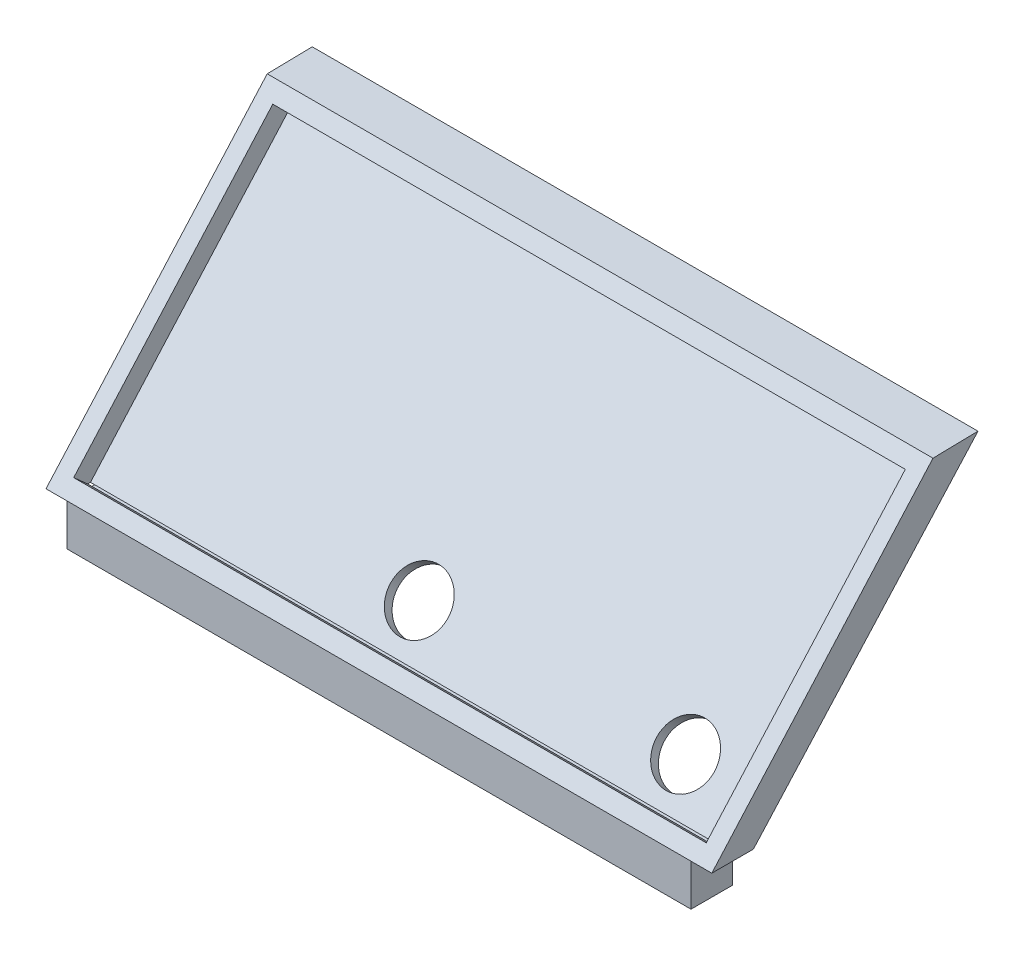
ISO-10303-21;
HEADER;
FILE_DESCRIPTION(('STEP AP214'),'2;1');
FILE_NAME('part.step','',(''),(''),'','','');
FILE_SCHEMA(('AUTOMOTIVE_DESIGN { 1 0 10303 214 1 1 1 1 }'));
ENDSEC;
DATA;
#1=APPLICATION_CONTEXT('core data for automotive mechanical design processes');
#2=APPLICATION_PROTOCOL_DEFINITION('international standard','automotive_design',2000,#1);
#3=PRODUCT_CONTEXT('',#1,'mechanical');
#4=PRODUCT('Part','Part','',(#3));
#5=PRODUCT_RELATED_PRODUCT_CATEGORY('part','',(#4));
#6=PRODUCT_DEFINITION_FORMATION('','',#4);
#7=PRODUCT_DEFINITION_CONTEXT('part definition',#1,'design');
#8=PRODUCT_DEFINITION('design','',#6,#7);
#9=PRODUCT_DEFINITION_SHAPE('','',#8);
#10=(LENGTH_UNIT() NAMED_UNIT(*) SI_UNIT(.MILLI.,.METRE.));
#11=(NAMED_UNIT(*) PLANE_ANGLE_UNIT() SI_UNIT($,.RADIAN.));
#12=(NAMED_UNIT(*) SI_UNIT($,.STERADIAN.) SOLID_ANGLE_UNIT());
#13=UNCERTAINTY_MEASURE_WITH_UNIT(LENGTH_MEASURE(1.E-05),#10,'distance_accuracy_value','');
#14=(GEOMETRIC_REPRESENTATION_CONTEXT(3) GLOBAL_UNCERTAINTY_ASSIGNED_CONTEXT((#13)) GLOBAL_UNIT_ASSIGNED_CONTEXT((#10,
#11,#12)) REPRESENTATION_CONTEXT('',''));
#15=CARTESIAN_POINT('',(0.,0.,0.));
#16=DIRECTION('',(0.,0.,1.));
#17=DIRECTION('',(1.,0.,0.));
#18=AXIS2_PLACEMENT_3D('',#15,#16,#17);
#19=CARTESIAN_POINT('',(48.26,25.4,-79.3512959841052));
#20=DIRECTION('',(0.,1.,0.));
#21=DIRECTION('',(-1.,0.,0.));
#22=AXIS2_PLACEMENT_3D('',#19,#20,#21);
#23=PLANE('',#22);
#24=DIRECTION('',(0.,0.,-1.));
#25=VECTOR('',#24,1.);
#26=CARTESIAN_POINT('',(-47.625,25.4,-73.0012959841052));
#27=LINE('',#26,#25);
#28=CARTESIAN_POINT('',(-47.625,25.4,-73.0012959841052));
#29=VERTEX_POINT('',#28);
#30=CARTESIAN_POINT('',(-47.625,25.4,-76.8238639337023));
#31=VERTEX_POINT('',#30);
#32=EDGE_CURVE('E57',#29,#31,#27,.T.);
#33=ORIENTED_EDGE('',*,*,#32,.F.);
#34=DIRECTION('',(-1.,0.,0.));
#35=VECTOR('',#34,1.);
#36=CARTESIAN_POINT('',(0.,25.4,-73.0012959841052));
#37=LINE('',#36,#35);
#38=CARTESIAN_POINT('',(-50.8,25.4,-73.0012959841052));
#39=VERTEX_POINT('',#38);
#40=EDGE_CURVE('E290',#29,#39,#37,.T.);
#41=ORIENTED_EDGE('',*,*,#40,.T.);
#42=DIRECTION('',(0.,0.,1.));
#43=VECTOR('',#42,1.);
#44=CARTESIAN_POINT('',(-50.8,25.4,-79.3512959841052));
#45=LINE('',#44,#43);
#46=CARTESIAN_POINT('',(-50.8,25.4,-79.3512959841052));
#47=VERTEX_POINT('',#46);
#48=EDGE_CURVE('E212',#47,#39,#45,.T.);
#49=ORIENTED_EDGE('',*,*,#48,.F.);
#50=DIRECTION('',(-1.,0.,0.));
#51=VECTOR('',#50,1.);
#52=CARTESIAN_POINT('',(0.,25.4,-79.3512959841052));
#53=LINE('',#52,#51);
#54=CARTESIAN_POINT('',(-47.625,25.4,-79.3512959841052));
#55=VERTEX_POINT('',#54);
#56=EDGE_CURVE('E65',#55,#47,#53,.T.);
#57=ORIENTED_EDGE('',*,*,#56,.F.);
#58=CARTESIAN_POINT('',(-47.625,25.4,-77.2498636105856));
#59=VERTEX_POINT('',#58);
#60=EDGE_CURVE('E11',#59,#55,#27,.T.);
#61=ORIENTED_EDGE('',*,*,#60,.F.);
#62=DIRECTION('',(1.,0.,0.));
#63=VECTOR('',#62,1.);
#64=CARTESIAN_POINT('',(48.26,25.4,-77.2498636105857));
#65=LINE('',#64,#63);
#66=CARTESIAN_POINT('',(-48.26,25.4,-77.2498636105856));
#67=VERTEX_POINT('',#66);
#68=EDGE_CURVE('E299',#67,#59,#65,.T.);
#69=ORIENTED_EDGE('',*,*,#68,.F.);
#70=DIRECTION('',(0.,0.,-1.));
#71=VECTOR('',#70,1.);
#72=CARTESIAN_POINT('',(-48.26,25.4,-200.66));
#73=LINE('',#72,#71);
#74=CARTESIAN_POINT('',(-48.26,25.4,-76.8238639337022));
#75=VERTEX_POINT('',#74);
#76=EDGE_CURVE('E217',#75,#67,#73,.T.);
#77=ORIENTED_EDGE('',*,*,#76,.F.);
#78=DIRECTION('',(1.,0.,0.));
#79=VECTOR('',#78,1.);
#80=CARTESIAN_POINT('',(48.26,25.4,-76.8238639337022));
#81=LINE('',#80,#79);
#82=EDGE_CURVE('E49',#75,#31,#81,.T.);
#83=ORIENTED_EDGE('',*,*,#82,.T.);
#84=EDGE_LOOP('',(#33,#41,#49,#57,#61,#69,#77,#83));
#85=FACE_BOUND('',#84,.T.);
#86=ADVANCED_FACE('F45',(#85),#23,.F.);
#87=DIRECTION('',(0.,0.,1.));
#88=VECTOR('',#87,1.);
#89=CARTESIAN_POINT('',(47.625,25.4,-73.0012959841052));
#90=LINE('',#89,#88);
#91=CARTESIAN_POINT('',(47.625,25.4,-79.3512959841052));
#92=VERTEX_POINT('',#91);
#93=CARTESIAN_POINT('',(47.625,25.4,-77.2498636105857));
#94=VERTEX_POINT('',#93);
#95=EDGE_CURVE('E73',#92,#94,#90,.T.);
#96=ORIENTED_EDGE('',*,*,#95,.F.);
#97=CARTESIAN_POINT('',(50.8,25.4,-79.3512959841052));
#98=VERTEX_POINT('',#97);
#99=EDGE_CURVE('E296',#98,#92,#53,.T.);
#100=ORIENTED_EDGE('',*,*,#99,.F.);
#101=DIRECTION('',(0.,0.,1.));
#102=VECTOR('',#101,1.);
#103=CARTESIAN_POINT('',(50.8,25.4,-79.3512959841052));
#104=LINE('',#103,#102);
#105=CARTESIAN_POINT('',(50.8,25.4,-73.0012959841052));
#106=VERTEX_POINT('',#105);
#107=EDGE_CURVE('E208',#98,#106,#104,.T.);
#108=ORIENTED_EDGE('',*,*,#107,.T.);
#109=CARTESIAN_POINT('',(47.625,25.4,-73.0012959841052));
#110=VERTEX_POINT('',#109);
#111=EDGE_CURVE('E293',#106,#110,#37,.T.);
#112=ORIENTED_EDGE('',*,*,#111,.T.);
#113=CARTESIAN_POINT('',(47.625,25.4,-76.8238639337022));
#114=VERTEX_POINT('',#113);
#115=EDGE_CURVE('E55',#114,#110,#90,.T.);
#116=ORIENTED_EDGE('',*,*,#115,.F.);
#117=CARTESIAN_POINT('',(48.26,25.4,-76.8238639337023));
#118=VERTEX_POINT('',#117);
#119=EDGE_CURVE('E302',#114,#118,#81,.T.);
#120=ORIENTED_EDGE('',*,*,#119,.T.);
#121=DIRECTION('',(0.,0.,1.));
#122=VECTOR('',#121,1.);
#123=CARTESIAN_POINT('',(48.26,25.4,-200.66));
#124=LINE('',#123,#122);
#125=CARTESIAN_POINT('',(48.26,25.4,-77.2498636105856));
#126=VERTEX_POINT('',#125);
#127=EDGE_CURVE('E216',#126,#118,#124,.T.);
#128=ORIENTED_EDGE('',*,*,#127,.F.);
#129=EDGE_CURVE('E298',#94,#126,#65,.T.);
#130=ORIENTED_EDGE('',*,*,#129,.F.);
#131=EDGE_LOOP('',(#96,#100,#108,#112,#116,#120,#128,#130));
#132=FACE_BOUND('',#131,.T.);
#133=ADVANCED_FACE('F315',(#132),#23,.F.);
#134=CARTESIAN_POINT('',(-50.8,-25.4,-228.6));
#135=DIRECTION('',(-1.,0.,0.));
#136=DIRECTION('',(0.,0.,1.));
#137=AXIS2_PLACEMENT_3D('',#134,#135,#136);
#138=PLANE('',#137);
#139=DIRECTION('',(0.,0.743475930468275,-0.668762693946315));
#140=VECTOR('',#139,1.);
#141=CARTESIAN_POINT('',(-50.8,25.4,-79.3512959841052));
#142=LINE('',#141,#140);
#143=CARTESIAN_POINT('',(-50.8,63.5,-113.622558300972));
#144=VERTEX_POINT('',#143);
#145=EDGE_CURVE('E269',#47,#144,#142,.T.);
#146=ORIENTED_EDGE('',*,*,#145,.F.);
#147=ORIENTED_EDGE('',*,*,#48,.T.);
#148=DIRECTION('',(0.,0.747310688950991,-0.664474780694945));
#149=VECTOR('',#148,1.);
#150=CARTESIAN_POINT('',(-50.8,25.4,-73.0012959841052));
#151=LINE('',#150,#149);
#152=CARTESIAN_POINT('',(-50.8,63.3633829987103,-106.756614843408));
#153=VERTEX_POINT('',#152);
#154=EDGE_CURVE('E254',#39,#153,#151,.T.);
#155=ORIENTED_EDGE('',*,*,#154,.T.);
#156=DIRECTION('',(0.,0.0198938376583019,-0.999802098029017));
#157=VECTOR('',#156,1.);
#158=CARTESIAN_POINT('',(-50.8,63.3633829987103,-106.756614843408));
#159=LINE('',#158,#157);
#160=EDGE_CURVE('E280',#153,#144,#159,.T.);
#161=ORIENTED_EDGE('',*,*,#160,.T.);
#162=EDGE_LOOP('',(#146,#147,#155,#161));
#163=FACE_BOUND('',#162,.T.);
#164=ADVANCED_FACE('F47',(#163),#138,.T.);
#165=CARTESIAN_POINT('',(48.26,-25.4,-200.66));
#166=DIRECTION('',(1.,0.,0.));
#167=DIRECTION('',(0.,0.,-1.));
#168=AXIS2_PLACEMENT_3D('',#165,#166,#167);
#169=PLANE('',#168);
#170=DIRECTION('',(0.,0.747310688950991,-0.664474780694945));
#171=VECTOR('',#170,1.);
#172=CARTESIAN_POINT('',(48.26,25.1884617212291,-77.0617733644898));
#173=LINE('',#172,#171);
#174=CARTESIAN_POINT('',(48.26,59.3555064200684,-107.441560337863));
#175=VERTEX_POINT('',#174);
#176=EDGE_CURVE('E229',#126,#175,#173,.T.);
#177=ORIENTED_EDGE('',*,*,#176,.F.);
#178=ORIENTED_EDGE('',*,*,#127,.T.);
#179=DIRECTION('',(0.,0.664474780694945,0.747310688950991));
#180=VECTOR('',#179,1.);
#181=CARTESIAN_POINT('',(48.26,25.1884617212291,-77.0617733644898));
#182=LINE('',#181,#180);
#183=CARTESIAN_POINT('',(48.26,27.2981691499355,-74.6890619270704));
#184=VERTEX_POINT('',#183);
#185=EDGE_CURVE('E258',#118,#184,#182,.T.);
#186=ORIENTED_EDGE('',*,*,#185,.T.);
#187=DIRECTION('',(0.,0.747310688950991,-0.664474780694945));
#188=VECTOR('',#187,1.);
#189=CARTESIAN_POINT('',(48.26,27.2981691499355,-74.6890619270704));
#190=LINE('',#189,#188);
#191=CARTESIAN_POINT('',(48.26,61.4652138487748,-105.068848900443));
#192=VERTEX_POINT('',#191);
#193=EDGE_CURVE('E244',#184,#192,#190,.T.);
#194=ORIENTED_EDGE('',*,*,#193,.T.);
#195=DIRECTION('',(0.,0.664474780694945,0.747310688950991));
#196=VECTOR('',#195,1.);
#197=CARTESIAN_POINT('',(48.26,59.3555064200684,-107.441560337863));
#198=LINE('',#197,#196);
#199=EDGE_CURVE('E255',#175,#192,#198,.T.);
#200=ORIENTED_EDGE('',*,*,#199,.F.);
#201=EDGE_LOOP('',(#177,#178,#186,#194,#200));
#202=FACE_BOUND('',#201,.T.);
#203=ADVANCED_FACE('F319',(#202),#169,.F.);
#204=CARTESIAN_POINT('',(-48.26,-25.4,-200.66));
#205=DIRECTION('',(-1.,0.,0.));
#206=DIRECTION('',(0.,-1.,0.));
#207=AXIS2_PLACEMENT_3D('',#204,#205,#206);
#208=PLANE('',#207);
#209=DIRECTION('',(0.,0.664474780694945,0.747310688950991));
#210=VECTOR('',#209,1.);
#211=CARTESIAN_POINT('',(-48.26,25.1884617212291,-77.0617733644898));
#212=LINE('',#211,#210);
#213=CARTESIAN_POINT('',(-48.26,27.2981691499355,-74.6890619270704));
#214=VERTEX_POINT('',#213);
#215=EDGE_CURVE('E237',#75,#214,#212,.T.);
#216=ORIENTED_EDGE('',*,*,#215,.F.);
#217=ORIENTED_EDGE('',*,*,#76,.T.);
#218=DIRECTION('',(0.,-0.747310688950991,0.664474780694945));
#219=VECTOR('',#218,1.);
#220=CARTESIAN_POINT('',(-48.26,25.1884617212291,-77.0617733644898));
#221=LINE('',#220,#219);
#222=CARTESIAN_POINT('',(-48.26,59.3555064200684,-107.441560337863));
#223=VERTEX_POINT('',#222);
#224=EDGE_CURVE('E225',#223,#67,#221,.T.);
#225=ORIENTED_EDGE('',*,*,#224,.F.);
#226=DIRECTION('',(0.,0.664474780694945,0.747310688950991));
#227=VECTOR('',#226,1.);
#228=CARTESIAN_POINT('',(-48.26,59.3555064200684,-107.441560337863));
#229=LINE('',#228,#227);
#230=CARTESIAN_POINT('',(-48.26,61.4652138487748,-105.068848900443));
#231=VERTEX_POINT('',#230);
#232=EDGE_CURVE('E251',#223,#231,#229,.T.);
#233=ORIENTED_EDGE('',*,*,#232,.T.);
#234=DIRECTION('',(0.,-0.747310688950991,0.664474780694945));
#235=VECTOR('',#234,1.);
#236=CARTESIAN_POINT('',(-48.26,27.2981691499355,-74.6890619270704));
#237=LINE('',#236,#235);
#238=EDGE_CURVE('E221',#231,#214,#237,.T.);
#239=ORIENTED_EDGE('',*,*,#238,.T.);
#240=EDGE_LOOP('',(#216,#217,#225,#233,#239));
#241=FACE_BOUND('',#240,.T.);
#242=ADVANCED_FACE('F329',(#241),#208,.F.);
#243=CARTESIAN_POINT('',(50.8,-25.4,-228.6));
#244=DIRECTION('',(1.,0.,0.));
#245=DIRECTION('',(0.,0.,-1.));
#246=AXIS2_PLACEMENT_3D('',#243,#244,#245);
#247=PLANE('',#246);
#248=ORIENTED_EDGE('',*,*,#107,.F.);
#249=DIRECTION('',(0.,0.743475930468275,-0.668762693946315));
#250=VECTOR('',#249,1.);
#251=CARTESIAN_POINT('',(50.8,25.4,-79.3512959841052));
#252=LINE('',#251,#250);
#253=CARTESIAN_POINT('',(50.8,63.5,-113.622558300972));
#254=VERTEX_POINT('',#253);
#255=EDGE_CURVE('E273',#98,#254,#252,.T.);
#256=ORIENTED_EDGE('',*,*,#255,.T.);
#257=DIRECTION('',(0.,0.0198938376583019,-0.999802098029017));
#258=VECTOR('',#257,1.);
#259=CARTESIAN_POINT('',(50.8,63.3633829987103,-106.756614843408));
#260=LINE('',#259,#258);
#261=CARTESIAN_POINT('',(50.8,63.3633829987103,-106.756614843408));
#262=VERTEX_POINT('',#261);
#263=EDGE_CURVE('E268',#262,#254,#260,.T.);
#264=ORIENTED_EDGE('',*,*,#263,.F.);
#265=DIRECTION('',(0.,0.747310688950991,-0.664474780694945));
#266=VECTOR('',#265,1.);
#267=CARTESIAN_POINT('',(50.8,25.4,-73.0012959841052));
#268=LINE('',#267,#266);
#269=EDGE_CURVE('E264',#106,#262,#268,.T.);
#270=ORIENTED_EDGE('',*,*,#269,.F.);
#271=EDGE_LOOP('',(#248,#256,#264,#270));
#272=FACE_BOUND('',#271,.T.);
#273=ADVANCED_FACE('F391',(#272),#247,.T.);
#274=CARTESIAN_POINT('',(50.8,25.4,-79.3512959841052));
#275=DIRECTION('',(0.,0.668762693946315,0.743475930468275));
#276=DIRECTION('',(0.,-0.743475930468275,0.668762693946315));
#277=AXIS2_PLACEMENT_3D('',#274,#275,#276);
#278=PLANE('',#277);
#279=CARTESIAN_POINT('',(-2.54,29.3446401177362,-82.89953210538));
#280=DIRECTION('',(0.,0.668762693946315,0.743475930468275));
#281=DIRECTION('',(0.,-0.743475930468275,0.668762693946315));
#282=AXIS2_PLACEMENT_3D('',#279,#280,#281);
#283=ELLIPSE('',#282,4.44507354723716,4.445);
#284=CARTESIAN_POINT('',(-2.54,26.0398349262041,-79.9268327451402));
#285=VERTEX_POINT('',#284);
#286=EDGE_CURVE('E191',#285,#285,#283,.T.);
#287=ORIENTED_EDGE('',*,*,#286,.T.);
#288=EDGE_LOOP('',(#287));
#289=FACE_BOUND('',#288,.T.);
#290=CARTESIAN_POINT('',(38.1,29.3446401177362,-82.89953210538));
#291=DIRECTION('',(0.,0.668762693946315,0.743475930468275));
#292=DIRECTION('',(0.,-0.743475930468275,0.668762693946315));
#293=AXIS2_PLACEMENT_3D('',#290,#291,#292);
#294=ELLIPSE('',#293,4.44507354723716,4.445);
#295=CARTESIAN_POINT('',(38.1,26.0398349262041,-79.9268327451402));
#296=VERTEX_POINT('',#295);
#297=EDGE_CURVE('E204',#296,#296,#294,.T.);
#298=ORIENTED_EDGE('',*,*,#297,.T.);
#299=EDGE_LOOP('',(#298));
#300=FACE_BOUND('',#299,.T.);
#301=ORIENTED_EDGE('',*,*,#145,.T.);
#302=DIRECTION('',(-1.,0.,0.));
#303=VECTOR('',#302,1.);
#304=CARTESIAN_POINT('',(50.8,63.5,-113.622558300972));
#305=LINE('',#304,#303);
#306=EDGE_CURVE('E287',#254,#144,#305,.T.);
#307=ORIENTED_EDGE('',*,*,#306,.F.);
#308=ORIENTED_EDGE('',*,*,#255,.F.);
#309=ORIENTED_EDGE('',*,*,#99,.T.);
#310=DIRECTION('',(1.,0.,0.));
#311=VECTOR('',#310,1.);
#312=CARTESIAN_POINT('',(47.625,25.4,-79.3512959841052));
#313=LINE('',#312,#311);
#314=EDGE_CURVE('E342',#55,#92,#313,.T.);
#315=ORIENTED_EDGE('',*,*,#314,.F.);
#316=ORIENTED_EDGE('',*,*,#56,.T.);
#317=EDGE_LOOP('',(#301,#307,#308,#309,#315,#316));
#318=FACE_BOUND('',#317,.T.);
#319=ADVANCED_FACE('F385',(#289,#300,#318),#278,.F.);
#320=CARTESIAN_POINT('',(50.8,63.3633829987103,-106.756614843408));
#321=DIRECTION('',(0.,0.999802098029018,0.019893837658302));
#322=DIRECTION('',(0.,-0.019893837658302,0.999802098029018));
#323=AXIS2_PLACEMENT_3D('',#320,#321,#322);
#324=PLANE('',#323);
#325=ORIENTED_EDGE('',*,*,#160,.F.);
#326=DIRECTION('',(-1.,0.,0.));
#327=VECTOR('',#326,1.);
#328=CARTESIAN_POINT('',(50.8,63.3633829987103,-106.756614843408));
#329=LINE('',#328,#327);
#330=EDGE_CURVE('E276',#262,#153,#329,.T.);
#331=ORIENTED_EDGE('',*,*,#330,.F.);
#332=ORIENTED_EDGE('',*,*,#263,.T.);
#333=ORIENTED_EDGE('',*,*,#306,.T.);
#334=EDGE_LOOP('',(#325,#331,#332,#333));
#335=FACE_BOUND('',#334,.T.);
#336=ADVANCED_FACE('F376',(#335),#324,.T.);
#337=CARTESIAN_POINT('',(50.8,25.4,-73.0012959841052));
#338=DIRECTION('',(0.,0.664474780694945,0.747310688950991));
#339=DIRECTION('',(0.,-0.747310688950991,0.664474780694945));
#340=AXIS2_PLACEMENT_3D('',#337,#338,#339);
#341=PLANE('',#340);
#342=ORIENTED_EDGE('',*,*,#238,.F.);
#343=DIRECTION('',(-1.,0.,0.));
#344=VECTOR('',#343,1.);
#345=CARTESIAN_POINT('',(48.26,61.4652138487748,-105.068848900443));
#346=LINE('',#345,#344);
#347=EDGE_CURVE('E230',#192,#231,#346,.T.);
#348=ORIENTED_EDGE('',*,*,#347,.F.);
#349=ORIENTED_EDGE('',*,*,#193,.F.);
#350=DIRECTION('',(1.,0.,0.));
#351=VECTOR('',#350,1.);
#352=CARTESIAN_POINT('',(48.26,27.2981691499355,-74.6890619270704));
#353=LINE('',#352,#351);
#354=EDGE_CURVE('E240',#214,#184,#353,.T.);
#355=ORIENTED_EDGE('',*,*,#354,.F.);
#356=EDGE_LOOP('',(#342,#348,#349,#355));
#357=FACE_BOUND('',#356,.T.);
#358=ORIENTED_EDGE('',*,*,#154,.F.);
#359=ORIENTED_EDGE('',*,*,#40,.F.);
#360=DIRECTION('',(-1.,0.,0.));
#361=VECTOR('',#360,1.);
#362=CARTESIAN_POINT('',(47.625,25.4,-73.0012959841052));
#363=LINE('',#362,#361);
#364=EDGE_CURVE('E180',#110,#29,#363,.T.);
#365=ORIENTED_EDGE('',*,*,#364,.F.);
#366=ORIENTED_EDGE('',*,*,#111,.F.);
#367=ORIENTED_EDGE('',*,*,#269,.T.);
#368=ORIENTED_EDGE('',*,*,#330,.T.);
#369=EDGE_LOOP('',(#358,#359,#365,#366,#367,#368));
#370=FACE_BOUND('',#369,.T.);
#371=ADVANCED_FACE('F373',(#357,#370),#341,.T.);
#372=CARTESIAN_POINT('',(48.26,25.1884617212291,-77.0617733644898));
#373=DIRECTION('',(0.,-0.747310688950991,0.664474780694945));
#374=DIRECTION('',(0.,-0.664474780694945,-0.747310688950991));
#375=AXIS2_PLACEMENT_3D('',#372,#373,#374);
#376=PLANE('',#375);
#377=ORIENTED_EDGE('',*,*,#215,.T.);
#378=ORIENTED_EDGE('',*,*,#354,.T.);
#379=ORIENTED_EDGE('',*,*,#185,.F.);
#380=ORIENTED_EDGE('',*,*,#119,.F.);
#381=EDGE_CURVE('E308',#31,#114,#81,.T.);
#382=ORIENTED_EDGE('',*,*,#381,.F.);
#383=ORIENTED_EDGE('',*,*,#82,.F.);
#384=EDGE_LOOP('',(#377,#378,#379,#380,#382,#383));
#385=FACE_BOUND('',#384,.T.);
#386=ADVANCED_FACE('F369',(#385),#376,.F.);
#387=CARTESIAN_POINT('',(0.,-27.1451166752874,-30.5291283185314));
#388=DIRECTION('',(0.,0.664474780694945,0.747310688950991));
#389=DIRECTION('',(0.,-0.747310688950991,0.664474780694945));
#390=AXIS2_PLACEMENT_3D('',#387,#388,#389);
#391=PLANE('',#390);
#392=CARTESIAN_POINT('',(-2.54,30.4084268835517,-81.7031297076439));
#393=DIRECTION('',(0.,0.664474780694945,0.747310688950991));
#394=DIRECTION('',(0.,-0.747310688950991,0.664474780694945));
#395=AXIS2_PLACEMENT_3D('',#392,#393,#394);
#396=CIRCLE('',#395,4.445);
#397=CARTESIAN_POINT('',(-2.54,27.0866308711646,-78.7495393074549));
#398=VERTEX_POINT('',#397);
#399=EDGE_CURVE('E186',#398,#398,#396,.T.);
#400=ORIENTED_EDGE('',*,*,#399,.F.);
#401=EDGE_LOOP('',(#400));
#402=FACE_BOUND('',#401,.T.);
#403=CARTESIAN_POINT('',(38.1,30.4084268835517,-81.7031297076439));
#404=DIRECTION('',(0.,0.664474780694945,0.747310688950991));
#405=DIRECTION('',(0.,-0.747310688950991,0.664474780694945));
#406=AXIS2_PLACEMENT_3D('',#403,#404,#405);
#407=CIRCLE('',#406,4.445);
#408=CARTESIAN_POINT('',(38.1,27.0866308711646,-78.7495393074549));
#409=VERTEX_POINT('',#408);
#410=EDGE_CURVE('E200',#409,#409,#407,.T.);
#411=ORIENTED_EDGE('',*,*,#410,.F.);
#412=EDGE_LOOP('',(#411));
#413=FACE_BOUND('',#412,.T.);
#414=ORIENTED_EDGE('',*,*,#68,.T.);
#415=EDGE_CURVE('E303',#59,#94,#65,.T.);
#416=ORIENTED_EDGE('',*,*,#415,.T.);
#417=ORIENTED_EDGE('',*,*,#129,.T.);
#418=ORIENTED_EDGE('',*,*,#176,.T.);
#419=DIRECTION('',(-1.,0.,0.));
#420=VECTOR('',#419,1.);
#421=CARTESIAN_POINT('',(48.26,59.3555064200684,-107.441560337863));
#422=LINE('',#421,#420);
#423=EDGE_CURVE('E233',#175,#223,#422,.T.);
#424=ORIENTED_EDGE('',*,*,#423,.T.);
#425=ORIENTED_EDGE('',*,*,#224,.T.);
#426=EDGE_LOOP('',(#414,#416,#417,#418,#424,#425));
#427=FACE_BOUND('',#426,.T.);
#428=ADVANCED_FACE('F311',(#402,#413,#427),#391,.T.);
#429=CARTESIAN_POINT('',(48.26,59.3555064200684,-107.441560337863));
#430=DIRECTION('',(0.,0.747310688950991,-0.664474780694945));
#431=DIRECTION('',(0.,0.664474780694945,0.747310688950991));
#432=AXIS2_PLACEMENT_3D('',#429,#430,#431);
#433=PLANE('',#432);
#434=ORIENTED_EDGE('',*,*,#347,.T.);
#435=ORIENTED_EDGE('',*,*,#232,.F.);
#436=ORIENTED_EDGE('',*,*,#423,.F.);
#437=ORIENTED_EDGE('',*,*,#199,.T.);
#438=EDGE_LOOP('',(#434,#435,#436,#437));
#439=FACE_BOUND('',#438,.T.);
#440=ADVANCED_FACE('F324',(#439),#433,.F.);
#441=CARTESIAN_POINT('',(38.1,28.7206609405866,-83.6012988575794));
#442=DIRECTION('',(0.,0.664474780694946,0.747310688950991));
#443=DIRECTION('',(0.,-0.747310688950991,0.664474780694946));
#444=AXIS2_PLACEMENT_3D('',#441,#442,#443);
#445=CYLINDRICAL_SURFACE('',#444,4.445);
#446=ORIENTED_EDGE('',*,*,#410,.T.);
#447=EDGE_LOOP('',(#446));
#448=FACE_BOUND('',#447,.T.);
#449=ORIENTED_EDGE('',*,*,#297,.F.);
#450=EDGE_LOOP('',(#449));
#451=FACE_BOUND('',#450,.T.);
#452=ADVANCED_FACE('F414',(#448,#451),#445,.F.);
#453=CARTESIAN_POINT('',(-2.54,28.7206609405866,-83.6012988575794));
#454=DIRECTION('',(0.,0.664474780694946,0.747310688950991));
#455=DIRECTION('',(0.,-0.747310688950991,0.664474780694946));
#456=AXIS2_PLACEMENT_3D('',#453,#454,#455);
#457=CYLINDRICAL_SURFACE('',#456,4.445);
#458=ORIENTED_EDGE('',*,*,#399,.T.);
#459=EDGE_LOOP('',(#458));
#460=FACE_BOUND('',#459,.T.);
#461=ORIENTED_EDGE('',*,*,#286,.F.);
#462=EDGE_LOOP('',(#461));
#463=FACE_BOUND('',#462,.T.);
#464=ADVANCED_FACE('F420',(#460,#463),#457,.F.);
#465=CARTESIAN_POINT('',(0.,25.4,0.));
#466=DIRECTION('',(0.,1.,0.));
#467=DIRECTION('',(-1.,0.,0.));
#468=AXIS2_PLACEMENT_3D('',#465,#466,#467);
#469=PLANE('',#468);
#470=ORIENTED_EDGE('',*,*,#415,.F.);
#471=EDGE_CURVE('E58',#31,#59,#27,.T.);
#472=ORIENTED_EDGE('',*,*,#471,.F.);
#473=ORIENTED_EDGE('',*,*,#381,.T.);
#474=EDGE_CURVE('E344',#94,#114,#90,.T.);
#475=ORIENTED_EDGE('',*,*,#474,.F.);
#476=EDGE_LOOP('',(#470,#472,#473,#475));
#477=FACE_BOUND('',#476,.T.);
#478=ADVANCED_FACE('F337',(#477),#469,.T.);
#479=CARTESIAN_POINT('',(-47.625,19.05,-73.0012959841052));
#480=DIRECTION('',(1.,0.,0.));
#481=DIRECTION('',(0.,0.,-1.));
#482=AXIS2_PLACEMENT_3D('',#479,#480,#481);
#483=PLANE('',#482);
#484=ORIENTED_EDGE('',*,*,#32,.T.);
#485=ORIENTED_EDGE('',*,*,#471,.T.);
#486=ORIENTED_EDGE('',*,*,#60,.T.);
#487=DIRECTION('',(0.,1.,0.));
#488=VECTOR('',#487,1.);
#489=CARTESIAN_POINT('',(-47.625,19.05,-79.3512959841052));
#490=LINE('',#489,#488);
#491=CARTESIAN_POINT('',(-47.625,19.05,-79.3512959841052));
#492=VERTEX_POINT('',#491);
#493=EDGE_CURVE('E163',#492,#55,#490,.T.);
#494=ORIENTED_EDGE('',*,*,#493,.F.);
#495=DIRECTION('',(0.,0.,-1.));
#496=VECTOR('',#495,1.);
#497=CARTESIAN_POINT('',(-47.625,19.05,-73.0012959841052));
#498=LINE('',#497,#496);
#499=CARTESIAN_POINT('',(-47.625,19.05,-73.0012959841052));
#500=VERTEX_POINT('',#499);
#501=EDGE_CURVE('E170',#500,#492,#498,.T.);
#502=ORIENTED_EDGE('',*,*,#501,.F.);
#503=DIRECTION('',(0.,1.,0.));
#504=VECTOR('',#503,1.);
#505=CARTESIAN_POINT('',(-47.625,19.05,-73.0012959841052));
#506=LINE('',#505,#504);
#507=EDGE_CURVE('E340',#500,#29,#506,.T.);
#508=ORIENTED_EDGE('',*,*,#507,.T.);
#509=EDGE_LOOP('',(#484,#485,#486,#494,#502,#508));
#510=FACE_BOUND('',#509,.T.);
#511=ADVANCED_FACE('F183',(#510),#483,.F.);
#512=CARTESIAN_POINT('',(47.625,19.05,-79.3512959841052));
#513=DIRECTION('',(0.,0.,1.));
#514=DIRECTION('',(1.,0.,0.));
#515=AXIS2_PLACEMENT_3D('',#512,#513,#514);
#516=PLANE('',#515);
#517=ORIENTED_EDGE('',*,*,#314,.T.);
#518=DIRECTION('',(0.,1.,0.));
#519=VECTOR('',#518,1.);
#520=CARTESIAN_POINT('',(47.625,19.05,-79.3512959841052));
#521=LINE('',#520,#519);
#522=CARTESIAN_POINT('',(47.625,19.05,-79.3512959841052));
#523=VERTEX_POINT('',#522);
#524=EDGE_CURVE('E165',#523,#92,#521,.T.);
#525=ORIENTED_EDGE('',*,*,#524,.F.);
#526=DIRECTION('',(1.,0.,0.));
#527=VECTOR('',#526,1.);
#528=CARTESIAN_POINT('',(47.625,19.05,-79.3512959841052));
#529=LINE('',#528,#527);
#530=EDGE_CURVE('E158',#492,#523,#529,.T.);
#531=ORIENTED_EDGE('',*,*,#530,.F.);
#532=ORIENTED_EDGE('',*,*,#493,.T.);
#533=EDGE_LOOP('',(#517,#525,#531,#532));
#534=FACE_BOUND('',#533,.T.);
#535=ADVANCED_FACE('F161',(#534),#516,.F.);
#536=CARTESIAN_POINT('',(47.625,19.05,-73.0012959841052));
#537=DIRECTION('',(-1.,0.,0.));
#538=DIRECTION('',(0.,-1.,0.));
#539=AXIS2_PLACEMENT_3D('',#536,#537,#538);
#540=PLANE('',#539);
#541=ORIENTED_EDGE('',*,*,#95,.T.);
#542=ORIENTED_EDGE('',*,*,#474,.T.);
#543=ORIENTED_EDGE('',*,*,#115,.T.);
#544=DIRECTION('',(0.,1.,0.));
#545=VECTOR('',#544,1.);
#546=CARTESIAN_POINT('',(47.625,19.05,-73.0012959841052));
#547=LINE('',#546,#545);
#548=CARTESIAN_POINT('',(47.625,19.05,-73.0012959841052));
#549=VERTEX_POINT('',#548);
#550=EDGE_CURVE('E193',#549,#110,#547,.T.);
#551=ORIENTED_EDGE('',*,*,#550,.F.);
#552=DIRECTION('',(0.,0.,1.));
#553=VECTOR('',#552,1.);
#554=CARTESIAN_POINT('',(47.625,19.05,-73.0012959841052));
#555=LINE('',#554,#553);
#556=EDGE_CURVE('E169',#523,#549,#555,.T.);
#557=ORIENTED_EDGE('',*,*,#556,.F.);
#558=ORIENTED_EDGE('',*,*,#524,.T.);
#559=EDGE_LOOP('',(#541,#542,#543,#551,#557,#558));
#560=FACE_BOUND('',#559,.T.);
#561=ADVANCED_FACE('F363',(#560),#540,.F.);
#562=CARTESIAN_POINT('',(47.625,19.05,-73.0012959841052));
#563=DIRECTION('',(0.,0.,-1.));
#564=DIRECTION('',(-1.,0.,0.));
#565=AXIS2_PLACEMENT_3D('',#562,#563,#564);
#566=PLANE('',#565);
#567=ORIENTED_EDGE('',*,*,#364,.T.);
#568=ORIENTED_EDGE('',*,*,#507,.F.);
#569=DIRECTION('',(-1.,0.,0.));
#570=VECTOR('',#569,1.);
#571=CARTESIAN_POINT('',(47.625,19.05,-73.0012959841052));
#572=LINE('',#571,#570);
#573=EDGE_CURVE('E175',#549,#500,#572,.T.);
#574=ORIENTED_EDGE('',*,*,#573,.F.);
#575=ORIENTED_EDGE('',*,*,#550,.T.);
#576=EDGE_LOOP('',(#567,#568,#574,#575));
#577=FACE_BOUND('',#576,.T.);
#578=ADVANCED_FACE('F359',(#577),#566,.F.);
#579=CARTESIAN_POINT('',(0.,19.05,0.));
#580=DIRECTION('',(0.,1.,0.));
#581=DIRECTION('',(-1.,0.,0.));
#582=AXIS2_PLACEMENT_3D('',#579,#580,#581);
#583=PLANE('',#582);
#584=ORIENTED_EDGE('',*,*,#501,.T.);
#585=ORIENTED_EDGE('',*,*,#530,.T.);
#586=ORIENTED_EDGE('',*,*,#556,.T.);
#587=ORIENTED_EDGE('',*,*,#573,.T.);
#588=EDGE_LOOP('',(#584,#585,#586,#587));
#589=FACE_BOUND('',#588,.T.);
#590=ADVANCED_FACE('F173',(#589),#583,.F.);
#591=CLOSED_SHELL('',(#86,#133,#164,#203,#242,#273,#319,#336,#371,#386,#428,#440,#452,#464,#478,
#511,#535,#561,#578,#590));
#592=MANIFOLD_SOLID_BREP('B2',#591);
#593=ADVANCED_BREP_SHAPE_REPRESENTATION('',(#18,#592),#14);
#594=SHAPE_DEFINITION_REPRESENTATION(#9,#593);
ENDSEC;
END-ISO-10303-21;
